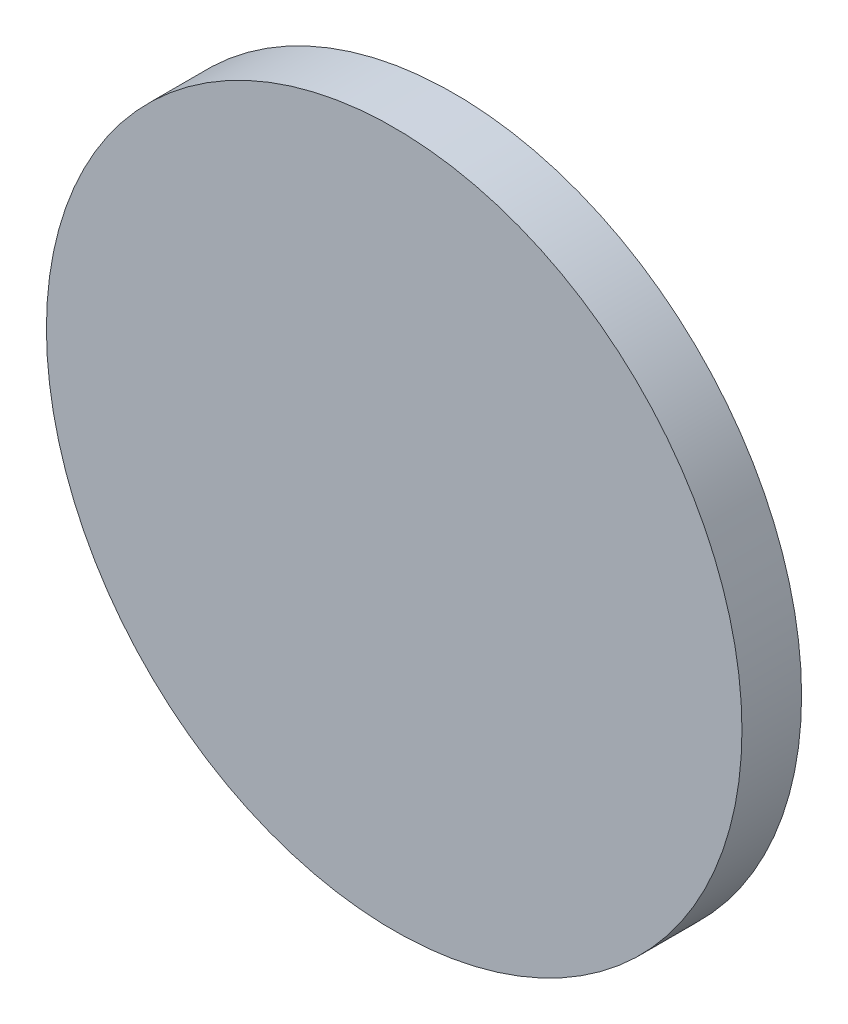
ISO-10303-21;
HEADER;
FILE_DESCRIPTION(('STEP AP214'),'2;1');
FILE_NAME('part.step','',(''),(''),'','','');
FILE_SCHEMA(('AUTOMOTIVE_DESIGN { 1 0 10303 214 1 1 1 1 }'));
ENDSEC;
DATA;
#1=APPLICATION_CONTEXT('core data for automotive mechanical design processes');
#2=APPLICATION_PROTOCOL_DEFINITION('international standard','automotive_design',2000,#1);
#3=PRODUCT_CONTEXT('',#1,'mechanical');
#4=PRODUCT('Part','Part','',(#3));
#5=PRODUCT_RELATED_PRODUCT_CATEGORY('part','',(#4));
#6=PRODUCT_DEFINITION_FORMATION('','',#4);
#7=PRODUCT_DEFINITION_CONTEXT('part definition',#1,'design');
#8=PRODUCT_DEFINITION('design','',#6,#7);
#9=PRODUCT_DEFINITION_SHAPE('','',#8);
#10=(LENGTH_UNIT() NAMED_UNIT(*) SI_UNIT(.MILLI.,.METRE.));
#11=(NAMED_UNIT(*) PLANE_ANGLE_UNIT() SI_UNIT($,.RADIAN.));
#12=(NAMED_UNIT(*) SI_UNIT($,.STERADIAN.) SOLID_ANGLE_UNIT());
#13=UNCERTAINTY_MEASURE_WITH_UNIT(LENGTH_MEASURE(1.E-05),#10,'distance_accuracy_value','');
#14=(GEOMETRIC_REPRESENTATION_CONTEXT(3) GLOBAL_UNCERTAINTY_ASSIGNED_CONTEXT((#13)) GLOBAL_UNIT_ASSIGNED_CONTEXT((#10,
#11,#12)) REPRESENTATION_CONTEXT('',''));
#15=CARTESIAN_POINT('',(0.,0.,0.));
#16=DIRECTION('',(0.,0.,1.));
#17=DIRECTION('',(1.,0.,0.));
#18=AXIS2_PLACEMENT_3D('',#15,#16,#17);
#19=CARTESIAN_POINT('',(5.8674,9.8171,0.79916));
#20=DIRECTION('',(0.,0.,1.));
#21=DIRECTION('',(1.,0.,0.));
#22=AXIS2_PLACEMENT_3D('',#19,#20,#21);
#23=PLANE('',#22);
#24=CARTESIAN_POINT('',(5.8674,9.8171,0.79916));
#25=DIRECTION('',(0.,0.,1.));
#26=DIRECTION('',(1.,0.,0.));
#27=AXIS2_PLACEMENT_3D('',#24,#25,#26);
#28=CIRCLE('',#27,0.200024667);
#29=CARTESIAN_POINT('',(6.067424667,9.8171,0.79916));
#30=VERTEX_POINT('',#29);
#31=EDGE_CURVE('E18',#30,#30,#28,.F.);
#32=ORIENTED_EDGE('',*,*,#31,.F.);
#33=EDGE_LOOP('',(#32));
#34=FACE_BOUND('',#33,.T.);
#35=ADVANCED_FACE('F15',(#34),#23,.T.);
#36=CARTESIAN_POINT('',(5.8674,9.8171,0.76487));
#37=DIRECTION('',(0.,0.,1.));
#38=DIRECTION('',(1.,0.,0.));
#39=AXIS2_PLACEMENT_3D('',#36,#37,#38);
#40=CYLINDRICAL_SURFACE('',#39,0.200024667);
#41=ORIENTED_EDGE('',*,*,#31,.T.);
#42=EDGE_LOOP('',(#41));
#43=FACE_BOUND('',#42,.T.);
#44=CARTESIAN_POINT('',(5.8674,9.8171,0.76487));
#45=DIRECTION('',(0.,0.,1.));
#46=DIRECTION('',(1.,0.,0.));
#47=AXIS2_PLACEMENT_3D('',#44,#45,#46);
#48=CIRCLE('',#47,0.200024667);
#49=CARTESIAN_POINT('',(6.067424667,9.8171,0.76487));
#50=VERTEX_POINT('',#49);
#51=EDGE_CURVE('E10',#50,#50,#48,.F.);
#52=ORIENTED_EDGE('',*,*,#51,.F.);
#53=EDGE_LOOP('',(#52));
#54=FACE_BOUND('',#53,.T.);
#55=ADVANCED_FACE('F27',(#43,#54),#40,.T.);
#56=CARTESIAN_POINT('',(5.8674,9.8171,0.76487));
#57=DIRECTION('',(0.,0.,-1.));
#58=DIRECTION('',(-1.,0.,0.));
#59=AXIS2_PLACEMENT_3D('',#56,#57,#58);
#60=PLANE('',#59);
#61=ORIENTED_EDGE('',*,*,#51,.T.);
#62=EDGE_LOOP('',(#61));
#63=FACE_BOUND('',#62,.T.);
#64=ADVANCED_FACE('F35',(#63),#60,.T.);
#65=CLOSED_SHELL('',(#35,#55,#64));
#66=MANIFOLD_SOLID_BREP('B1',#65);
#67=ADVANCED_BREP_SHAPE_REPRESENTATION('',(#18,#66),#14);
#68=SHAPE_DEFINITION_REPRESENTATION(#9,#67);
ENDSEC;
END-ISO-10303-21;
